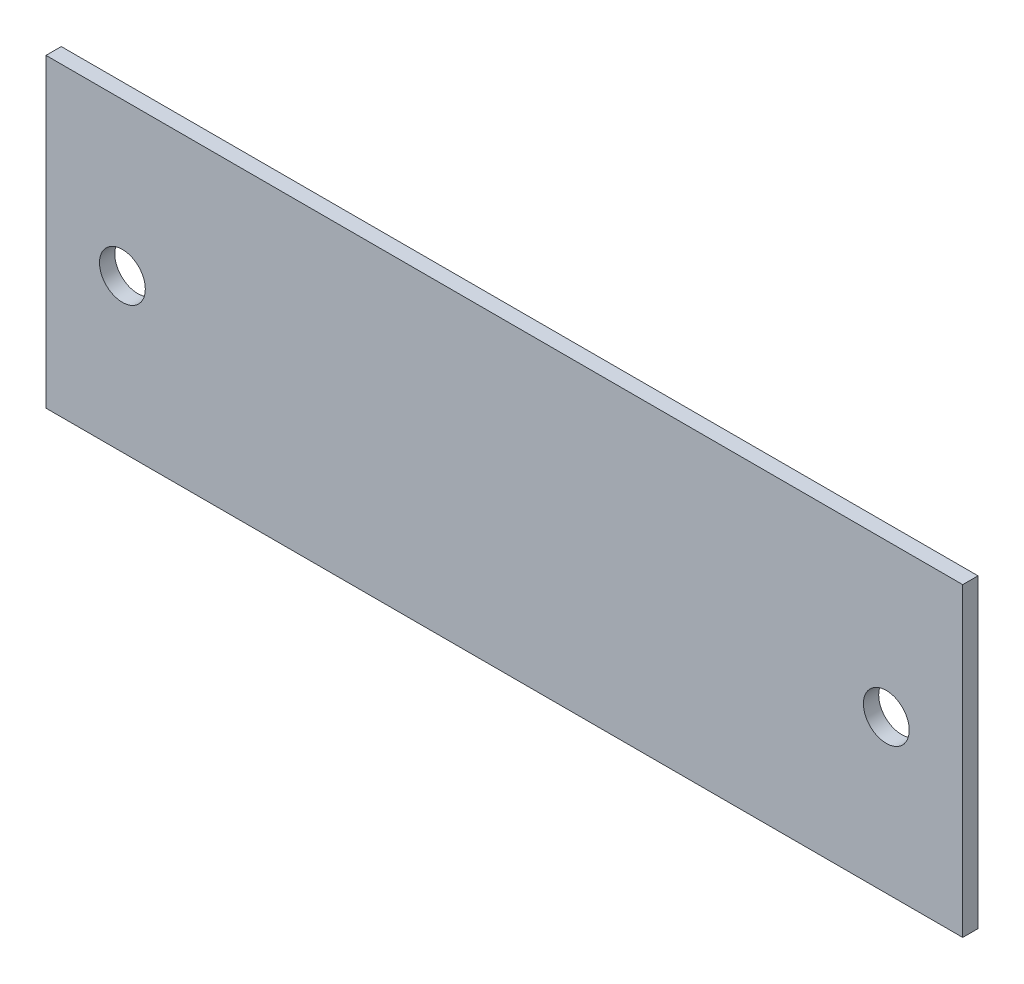
ISO-10303-21;
HEADER;
FILE_DESCRIPTION(('STEP AP214'),'2;1');
FILE_NAME('part.step','',(''),(''),'','','');
FILE_SCHEMA(('AUTOMOTIVE_DESIGN { 1 0 10303 214 1 1 1 1 }'));
ENDSEC;
DATA;
#1=APPLICATION_CONTEXT('core data for automotive mechanical design processes');
#2=APPLICATION_PROTOCOL_DEFINITION('international standard','automotive_design',2000,#1);
#3=PRODUCT_CONTEXT('',#1,'mechanical');
#4=PRODUCT('Part','Part','',(#3));
#5=PRODUCT_RELATED_PRODUCT_CATEGORY('part','',(#4));
#6=PRODUCT_DEFINITION_FORMATION('','',#4);
#7=PRODUCT_DEFINITION_CONTEXT('part definition',#1,'design');
#8=PRODUCT_DEFINITION('design','',#6,#7);
#9=PRODUCT_DEFINITION_SHAPE('','',#8);
#10=(LENGTH_UNIT() NAMED_UNIT(*) SI_UNIT(.MILLI.,.METRE.));
#11=(NAMED_UNIT(*) PLANE_ANGLE_UNIT() SI_UNIT($,.RADIAN.));
#12=(NAMED_UNIT(*) SI_UNIT($,.STERADIAN.) SOLID_ANGLE_UNIT());
#13=UNCERTAINTY_MEASURE_WITH_UNIT(LENGTH_MEASURE(1.E-05),#10,'distance_accuracy_value','');
#14=(GEOMETRIC_REPRESENTATION_CONTEXT(3) GLOBAL_UNCERTAINTY_ASSIGNED_CONTEXT((#13)) GLOBAL_UNIT_ASSIGNED_CONTEXT((#10,
#11,#12)) REPRESENTATION_CONTEXT('',''));
#15=CARTESIAN_POINT('',(0.,0.,0.));
#16=DIRECTION('',(0.,0.,1.));
#17=DIRECTION('',(1.,0.,0.));
#18=AXIS2_PLACEMENT_3D('',#15,#16,#17);
#19=CARTESIAN_POINT('',(-72.6247040134919,-28.6397959183674,1.));
#20=DIRECTION('',(1.,0.,0.));
#21=DIRECTION('',(0.,0.,-1.));
#22=AXIS2_PLACEMENT_3D('',#19,#20,#21);
#23=PLANE('',#22);
#24=DIRECTION('',(0.,-1.,0.));
#25=VECTOR('',#24,1.);
#26=CARTESIAN_POINT('',(-72.6247040134919,-28.6397959183674,0.));
#27=LINE('',#26,#25);
#28=CARTESIAN_POINT('',(-72.6247040134919,-8.63979591836736,0.));
#29=VERTEX_POINT('',#28);
#30=CARTESIAN_POINT('',(-72.6247040134919,-28.6397959183674,0.));
#31=VERTEX_POINT('',#30);
#32=EDGE_CURVE('E96',#29,#31,#27,.T.);
#33=ORIENTED_EDGE('',*,*,#32,.T.);
#34=DIRECTION('',(0.,0.,-1.));
#35=VECTOR('',#34,1.);
#36=CARTESIAN_POINT('',(-72.6247040134919,-28.6397959183674,1.));
#37=LINE('',#36,#35);
#38=CARTESIAN_POINT('',(-72.6247040134919,-28.6397959183674,1.));
#39=VERTEX_POINT('',#38);
#40=EDGE_CURVE('E11',#39,#31,#37,.T.);
#41=ORIENTED_EDGE('',*,*,#40,.F.);
#42=DIRECTION('',(0.,-1.,0.));
#43=VECTOR('',#42,1.);
#44=CARTESIAN_POINT('',(-72.6247040134919,-28.6397959183674,1.));
#45=LINE('',#44,#43);
#46=CARTESIAN_POINT('',(-72.6247040134919,-8.63979591836736,1.));
#47=VERTEX_POINT('',#46);
#48=EDGE_CURVE('E84',#47,#39,#45,.T.);
#49=ORIENTED_EDGE('',*,*,#48,.F.);
#50=DIRECTION('',(0.,0.,-1.));
#51=VECTOR('',#50,1.);
#52=CARTESIAN_POINT('',(-72.6247040134919,-8.63979591836736,1.));
#53=LINE('',#52,#51);
#54=EDGE_CURVE('E92',#47,#29,#53,.T.);
#55=ORIENTED_EDGE('',*,*,#54,.T.);
#56=EDGE_LOOP('',(#33,#41,#49,#55));
#57=FACE_BOUND('',#56,.T.);
#58=ADVANCED_FACE('F33',(#57),#23,.F.);
#59=CARTESIAN_POINT('',(-72.6247040134919,-28.6397959183674,1.));
#60=DIRECTION('',(0.,1.,0.));
#61=DIRECTION('',(0.,0.,1.));
#62=AXIS2_PLACEMENT_3D('',#59,#60,#61);
#63=PLANE('',#62);
#64=DIRECTION('',(1.,0.,0.));
#65=VECTOR('',#64,1.);
#66=CARTESIAN_POINT('',(-72.6247040134919,-28.6397959183674,0.));
#67=LINE('',#66,#65);
#68=CARTESIAN_POINT('',(-12.6247040134919,-28.6397959183674,0.));
#69=VERTEX_POINT('',#68);
#70=EDGE_CURVE('E88',#31,#69,#67,.T.);
#71=ORIENTED_EDGE('',*,*,#70,.T.);
#72=DIRECTION('',(0.,0.,-1.));
#73=VECTOR('',#72,1.);
#74=CARTESIAN_POINT('',(-12.6247040134919,-28.6397959183674,1.));
#75=LINE('',#74,#73);
#76=CARTESIAN_POINT('',(-12.6247040134919,-28.6397959183674,1.));
#77=VERTEX_POINT('',#76);
#78=EDGE_CURVE('E41',#77,#69,#75,.T.);
#79=ORIENTED_EDGE('',*,*,#78,.F.);
#80=DIRECTION('',(1.,0.,0.));
#81=VECTOR('',#80,1.);
#82=CARTESIAN_POINT('',(-72.6247040134919,-28.6397959183674,1.));
#83=LINE('',#82,#81);
#84=EDGE_CURVE('E79',#39,#77,#83,.T.);
#85=ORIENTED_EDGE('',*,*,#84,.F.);
#86=ORIENTED_EDGE('',*,*,#40,.T.);
#87=EDGE_LOOP('',(#71,#79,#85,#86));
#88=FACE_BOUND('',#87,.T.);
#89=ADVANCED_FACE('F87',(#88),#63,.F.);
#90=CARTESIAN_POINT('',(-12.6247040134919,-28.6397959183674,1.));
#91=DIRECTION('',(-1.,0.,0.));
#92=DIRECTION('',(0.,0.,1.));
#93=AXIS2_PLACEMENT_3D('',#90,#91,#92);
#94=PLANE('',#93);
#95=DIRECTION('',(0.,1.,0.));
#96=VECTOR('',#95,1.);
#97=CARTESIAN_POINT('',(-12.6247040134919,-28.6397959183674,0.));
#98=LINE('',#97,#96);
#99=CARTESIAN_POINT('',(-12.6247040134919,-8.63979591836736,0.));
#100=VERTEX_POINT('',#99);
#101=EDGE_CURVE('E66',#69,#100,#98,.T.);
#102=ORIENTED_EDGE('',*,*,#101,.T.);
#103=DIRECTION('',(0.,0.,-1.));
#104=VECTOR('',#103,1.);
#105=CARTESIAN_POINT('',(-12.6247040134919,-8.63979591836736,1.));
#106=LINE('',#105,#104);
#107=CARTESIAN_POINT('',(-12.6247040134919,-8.63979591836736,1.));
#108=VERTEX_POINT('',#107);
#109=EDGE_CURVE('E89',#108,#100,#106,.T.);
#110=ORIENTED_EDGE('',*,*,#109,.F.);
#111=DIRECTION('',(0.,1.,0.));
#112=VECTOR('',#111,1.);
#113=CARTESIAN_POINT('',(-12.6247040134919,-28.6397959183674,1.));
#114=LINE('',#113,#112);
#115=EDGE_CURVE('E82',#77,#108,#114,.T.);
#116=ORIENTED_EDGE('',*,*,#115,.F.);
#117=ORIENTED_EDGE('',*,*,#78,.T.);
#118=EDGE_LOOP('',(#102,#110,#116,#117));
#119=FACE_BOUND('',#118,.T.);
#120=ADVANCED_FACE('F90',(#119),#94,.F.);
#121=CARTESIAN_POINT('',(-72.6247040134919,-8.63979591836736,1.));
#122=DIRECTION('',(0.,-1.,0.));
#123=DIRECTION('',(0.,0.,-1.));
#124=AXIS2_PLACEMENT_3D('',#121,#122,#123);
#125=PLANE('',#124);
#126=DIRECTION('',(-1.,0.,0.));
#127=VECTOR('',#126,1.);
#128=CARTESIAN_POINT('',(-72.6247040134919,-8.63979591836736,0.));
#129=LINE('',#128,#127);
#130=EDGE_CURVE('E72',#100,#29,#129,.T.);
#131=ORIENTED_EDGE('',*,*,#130,.T.);
#132=ORIENTED_EDGE('',*,*,#54,.F.);
#133=DIRECTION('',(-1.,0.,0.));
#134=VECTOR('',#133,1.);
#135=CARTESIAN_POINT('',(-72.6247040134919,-8.63979591836736,1.));
#136=LINE('',#135,#134);
#137=EDGE_CURVE('E49',#108,#47,#136,.T.);
#138=ORIENTED_EDGE('',*,*,#137,.F.);
#139=ORIENTED_EDGE('',*,*,#109,.T.);
#140=EDGE_LOOP('',(#131,#132,#138,#139));
#141=FACE_BOUND('',#140,.T.);
#142=ADVANCED_FACE('F104',(#141),#125,.F.);
#143=CARTESIAN_POINT('',(0.,0.,1.));
#144=DIRECTION('',(0.,0.,-1.));
#145=DIRECTION('',(-1.,0.,0.));
#146=AXIS2_PLACEMENT_3D('',#143,#144,#145);
#147=PLANE('',#146);
#148=CARTESIAN_POINT('',(-17.6247040134919,-18.6397959183674,1.));
#149=DIRECTION('',(0.,0.,1.));
#150=DIRECTION('',(-1.,0.,0.));
#151=AXIS2_PLACEMENT_3D('',#148,#149,#150);
#152=CIRCLE('',#151,1.5);
#153=CARTESIAN_POINT('',(-19.1247040134919,-18.6397959183674,1.));
#154=VERTEX_POINT('',#153);
#155=EDGE_CURVE('E116',#154,#154,#152,.T.);
#156=ORIENTED_EDGE('',*,*,#155,.F.);
#157=EDGE_LOOP('',(#156));
#158=FACE_BOUND('',#157,.T.);
#159=CARTESIAN_POINT('',(-67.6247040134919,-18.6397959183674,1.));
#160=DIRECTION('',(0.,0.,1.));
#161=DIRECTION('',(1.,0.,0.));
#162=AXIS2_PLACEMENT_3D('',#159,#160,#161);
#163=CIRCLE('',#162,1.5);
#164=CARTESIAN_POINT('',(-66.1247040134919,-18.6397959183674,1.));
#165=VERTEX_POINT('',#164);
#166=EDGE_CURVE('E110',#165,#165,#163,.T.);
#167=ORIENTED_EDGE('',*,*,#166,.F.);
#168=EDGE_LOOP('',(#167));
#169=FACE_BOUND('',#168,.T.);
#170=ORIENTED_EDGE('',*,*,#48,.T.);
#171=ORIENTED_EDGE('',*,*,#84,.T.);
#172=ORIENTED_EDGE('',*,*,#115,.T.);
#173=ORIENTED_EDGE('',*,*,#137,.T.);
#174=EDGE_LOOP('',(#170,#171,#172,#173));
#175=FACE_BOUND('',#174,.T.);
#176=ADVANCED_FACE('F80',(#158,#169,#175),#147,.F.);
#177=CARTESIAN_POINT('',(0.,0.,0.));
#178=DIRECTION('',(0.,0.,-1.));
#179=DIRECTION('',(-1.,0.,0.));
#180=AXIS2_PLACEMENT_3D('',#177,#178,#179);
#181=PLANE('',#180);
#182=CARTESIAN_POINT('',(-17.6247040134919,-18.6397959183674,0.));
#183=DIRECTION('',(0.,0.,1.));
#184=DIRECTION('',(-1.,0.,0.));
#185=AXIS2_PLACEMENT_3D('',#182,#183,#184);
#186=CIRCLE('',#185,1.5);
#187=CARTESIAN_POINT('',(-19.1247040134919,-18.6397959183674,0.));
#188=VERTEX_POINT('',#187);
#189=EDGE_CURVE('E113',#188,#188,#186,.T.);
#190=ORIENTED_EDGE('',*,*,#189,.T.);
#191=EDGE_LOOP('',(#190));
#192=FACE_BOUND('',#191,.T.);
#193=CARTESIAN_POINT('',(-67.6247040134919,-18.6397959183674,0.));
#194=DIRECTION('',(0.,0.,1.));
#195=DIRECTION('',(1.,0.,0.));
#196=AXIS2_PLACEMENT_3D('',#193,#194,#195);
#197=CIRCLE('',#196,1.5);
#198=CARTESIAN_POINT('',(-66.1247040134919,-18.6397959183674,0.));
#199=VERTEX_POINT('',#198);
#200=EDGE_CURVE('E99',#199,#199,#197,.T.);
#201=ORIENTED_EDGE('',*,*,#200,.T.);
#202=EDGE_LOOP('',(#201));
#203=FACE_BOUND('',#202,.T.);
#204=ORIENTED_EDGE('',*,*,#32,.F.);
#205=ORIENTED_EDGE('',*,*,#130,.F.);
#206=ORIENTED_EDGE('',*,*,#101,.F.);
#207=ORIENTED_EDGE('',*,*,#70,.F.);
#208=EDGE_LOOP('',(#204,#205,#206,#207));
#209=FACE_BOUND('',#208,.T.);
#210=ADVANCED_FACE('F107',(#192,#203,#209),#181,.T.);
#211=CARTESIAN_POINT('',(-67.6247040134919,-18.6397959183674,0.));
#212=DIRECTION('',(0.,0.,1.));
#213=DIRECTION('',(1.,0.,0.));
#214=AXIS2_PLACEMENT_3D('',#211,#212,#213);
#215=CYLINDRICAL_SURFACE('',#214,1.5);
#216=ORIENTED_EDGE('',*,*,#200,.F.);
#217=EDGE_LOOP('',(#216));
#218=FACE_BOUND('',#217,.T.);
#219=ORIENTED_EDGE('',*,*,#166,.T.);
#220=EDGE_LOOP('',(#219));
#221=FACE_BOUND('',#220,.T.);
#222=ADVANCED_FACE('F127',(#218,#221),#215,.F.);
#223=CARTESIAN_POINT('',(-17.6247040134919,-18.6397959183674,0.));
#224=DIRECTION('',(0.,0.,1.));
#225=DIRECTION('',(1.,0.,0.));
#226=AXIS2_PLACEMENT_3D('',#223,#224,#225);
#227=CYLINDRICAL_SURFACE('',#226,1.5);
#228=ORIENTED_EDGE('',*,*,#189,.F.);
#229=EDGE_LOOP('',(#228));
#230=FACE_BOUND('',#229,.T.);
#231=ORIENTED_EDGE('',*,*,#155,.T.);
#232=EDGE_LOOP('',(#231));
#233=FACE_BOUND('',#232,.T.);
#234=ADVANCED_FACE('F124',(#230,#233),#227,.F.);
#235=CLOSED_SHELL('',(#58,#89,#120,#142,#176,#210,#222,#234));
#236=MANIFOLD_SOLID_BREP('B2',#235);
#237=ADVANCED_BREP_SHAPE_REPRESENTATION('',(#18,#236),#14);
#238=SHAPE_DEFINITION_REPRESENTATION(#9,#237);
ENDSEC;
END-ISO-10303-21;
